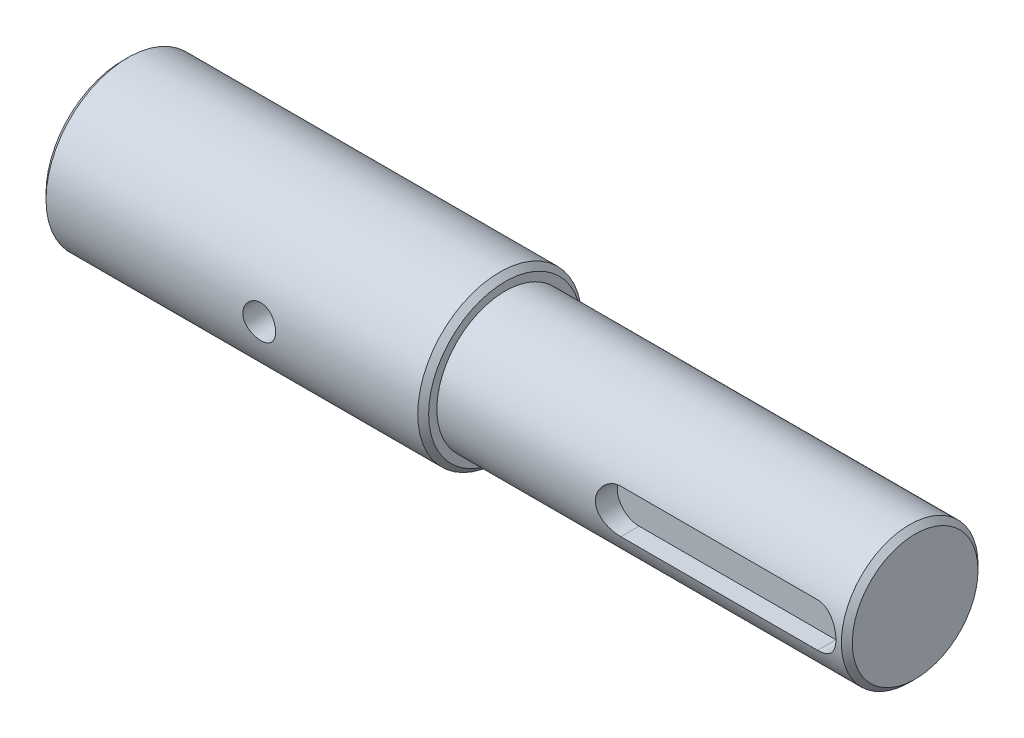
ISO-10303-21;
HEADER;
FILE_DESCRIPTION(('STEP AP214'),'2;1');
FILE_NAME('part.step','',(''),(''),'','','');
FILE_SCHEMA(('AUTOMOTIVE_DESIGN { 1 0 10303 214 1 1 1 1 }'));
ENDSEC;
DATA;
#1=APPLICATION_CONTEXT('core data for automotive mechanical design processes');
#2=APPLICATION_PROTOCOL_DEFINITION('international standard','automotive_design',2000,#1);
#3=PRODUCT_CONTEXT('',#1,'mechanical');
#4=PRODUCT('Part','Part','',(#3));
#5=PRODUCT_RELATED_PRODUCT_CATEGORY('part','',(#4));
#6=PRODUCT_DEFINITION_FORMATION('','',#4);
#7=PRODUCT_DEFINITION_CONTEXT('part definition',#1,'design');
#8=PRODUCT_DEFINITION('design','',#6,#7);
#9=PRODUCT_DEFINITION_SHAPE('','',#8);
#10=(LENGTH_UNIT() NAMED_UNIT(*) SI_UNIT(.MILLI.,.METRE.));
#11=(NAMED_UNIT(*) PLANE_ANGLE_UNIT() SI_UNIT($,.RADIAN.));
#12=(NAMED_UNIT(*) SI_UNIT($,.STERADIAN.) SOLID_ANGLE_UNIT());
#13=UNCERTAINTY_MEASURE_WITH_UNIT(LENGTH_MEASURE(1.E-05),#10,'distance_accuracy_value','');
#14=(GEOMETRIC_REPRESENTATION_CONTEXT(3) GLOBAL_UNCERTAINTY_ASSIGNED_CONTEXT((#13)) GLOBAL_UNIT_ASSIGNED_CONTEXT((#10,
#11,#12)) REPRESENTATION_CONTEXT('',''));
#15=CARTESIAN_POINT('',(0.,0.,0.));
#16=DIRECTION('',(0.,0.,1.));
#17=DIRECTION('',(1.,0.,0.));
#18=AXIS2_PLACEMENT_3D('',#15,#16,#17);
#19=CARTESIAN_POINT('',(75.,0.,0.));
#20=DIRECTION('',(-1.,0.,0.));
#21=DIRECTION('',(0.,0.,1.));
#22=AXIS2_PLACEMENT_3D('',#19,#20,#21);
#23=CYLINDRICAL_SURFACE('',#22,12.5);
#24=DIRECTION('',(-1.,0.,0.));
#25=VECTOR('',#24,1.);
#26=CARTESIAN_POINT('',(75.,-4.,11.842719282327));
#27=LINE('',#26,#25);
#28=CARTESIAN_POINT('',(68.9999992774947,-4.,11.842719282327));
#29=VERTEX_POINT('',#28);
#30=CARTESIAN_POINT('',(33.0000000860771,-4.,11.842719282327));
#31=VERTEX_POINT('',#30);
#32=EDGE_CURVE('E62',#29,#31,#27,.T.);
#33=ORIENTED_EDGE('',*,*,#32,.T.);
#34=CARTESIAN_POINT('',(33.0000000860771,-4.,11.842719282327));
#35=CARTESIAN_POINT('',(32.8906003144018,-4.00001410720039,11.8427027358106));
#36=CARTESIAN_POINT('',(32.7812098766924,-3.99551217993266,11.8442348036386));
#37=CARTESIAN_POINT('',(32.5632718459371,-3.97758607629383,11.8502730878636));
#38=CARTESIAN_POINT('',(32.4547240481456,-3.96416414063515,11.8547785573379));
#39=CARTESIAN_POINT('',(32.2395390554807,-3.92855726789797,11.866624202097));
#40=CARTESIAN_POINT('',(32.1328973904551,-3.90639677931233,11.8739564673804));
#41=CARTESIAN_POINT('',(31.9219944469661,-3.85353583875294,11.8912164916387));
#42=CARTESIAN_POINT('',(31.817733244712,-3.82283511378139,11.9011443335834));
#43=CARTESIAN_POINT('',(31.5096950788663,-3.71831767825502,11.934384073915));
#44=CARTESIAN_POINT('',(31.3103635295203,-3.63203547932865,11.9611699706487));
#45=CARTESIAN_POINT('',(30.9289875207174,-3.4289502588609,12.0209583821583));
#46=CARTESIAN_POINT('',(30.7469526964363,-3.31213036056589,12.0539643316417));
#47=CARTESIAN_POINT('',(30.3987460817276,-3.04678513884216,12.1237983926791));
#48=CARTESIAN_POINT('',(30.2332817430625,-2.89735310326957,12.1607158394894));
#49=CARTESIAN_POINT('',(29.9292852122408,-2.57296457099412,12.2334560987869));
#50=CARTESIAN_POINT('',(29.7907577088253,-2.39800363988275,12.2692787197911));
#51=CARTESIAN_POINT('',(29.5413848502421,-2.02237011324175,12.3368244517213));
#52=CARTESIAN_POINT('',(29.4312780873227,-1.82118403127888,12.3684294845299));
#53=CARTESIAN_POINT('',(29.2467505383842,-1.40197206380839,12.4229251547674));
#54=CARTESIAN_POINT('',(29.1723195547141,-1.18395101116351,12.4458182820424));
#55=CARTESIAN_POINT('',(29.0636411535197,-0.744714055182615,12.4796767755156));
#56=CARTESIAN_POINT('',(29.0281750790147,-0.52382801439202,12.4910030459863));
#57=CARTESIAN_POINT('',(28.9945672027649,-0.0789649088220831,12.501728711702));
#58=CARTESIAN_POINT('',(28.9964172630679,0.14501147136495,12.5011307074089));
#59=CARTESIAN_POINT('',(29.0365988159391,0.581094883607384,12.4883236715739));
#60=CARTESIAN_POINT('',(29.0736077498426,0.793338137008353,12.4765355857665));
#61=CARTESIAN_POINT('',(29.1808805241954,1.2084231135563,12.4431945873892));
#62=CARTESIAN_POINT('',(29.2511461755506,1.41126432407961,12.4216411430755));
#63=CARTESIAN_POINT('',(29.4237578014742,1.80478540726095,12.3706365105614));
#64=CARTESIAN_POINT('',(29.5264964745894,1.99528004806139,12.3410893195186));
#65=CARTESIAN_POINT('',(29.7608289950247,2.35673105677297,12.2771965545967));
#66=CARTESIAN_POINT('',(29.8924301481586,2.52768246110636,12.2428497666201));
#67=CARTESIAN_POINT('',(30.1874464647671,2.85304504965692,12.1712409251397));
#68=CARTESIAN_POINT('',(30.3519966320241,3.00641307161156,12.1339170507136));
#69=CARTESIAN_POINT('',(30.7049718219218,3.2837728630848,12.0618173045539));
#70=CARTESIAN_POINT('',(30.893404177119,3.40775557672525,12.0270422205738));
#71=CARTESIAN_POINT('',(31.1913711515791,3.56958203866888,11.9796198563288));
#72=CARTESIAN_POINT('',(31.2939989719462,3.61975670379803,11.9645161969642));
#73=CARTESIAN_POINT('',(31.5034046634222,3.7112307155423,11.936459169272));
#74=CARTESIAN_POINT('',(31.6101807975484,3.75253373059183,11.9235049126708));
#75=CARTESIAN_POINT('',(31.8270132360533,3.82585828763705,11.9001802433554));
#76=CARTESIAN_POINT('',(31.9370658854422,3.85788977366387,11.8898070640369));
#77=CARTESIAN_POINT('',(32.1596950632767,3.91241788552327,11.8719756739566));
#78=CARTESIAN_POINT('',(32.2722704096788,3.93491888254549,11.8645161269702));
#79=CARTESIAN_POINT('',(32.4872391399292,3.96832907132968,11.8533815935191));
#80=CARTESIAN_POINT('',(32.5894672983257,3.98020383324301,11.8493925990071));
#81=CARTESIAN_POINT('',(32.7944609376348,3.99603936376475,11.8440568041667));
#82=CARTESIAN_POINT('',(32.8972254864893,4.0000109913216,11.8427063784772));
#83=CARTESIAN_POINT('',(32.9999998369996,4.,11.842719282327));
#84=B_SPLINE_CURVE_WITH_KNOTS('',3,(#34,#35,#36,#37,#38,#39,#40,#41,#42,#43,#44,#45,#46,#47,#48,
#49,#50,#51,#52,#53,#54,#55,#56,#57,#58,#59,#60,#61,#62,#63,#64,#65,#66,#67,#68,#69,#70,#71,#72,
#73,#74,#75,#76,#77,#78,#79,#80,#81,#82,#83),.UNSPECIFIED.,.F.,.F.,(4,2,2,2,2,2,2,2,2,2,2,2,2,2,
2,2,2,2,2,2,2,2,2,2,4),(0.,0.328080176128682,0.656077969420186,0.983164536815614,
1.3102615610856,1.96355293479359,2.61720611810545,3.29209427005868,3.96709979098891,
4.65819583583337,5.34909421813099,6.01770820159006,6.68617637440314,7.33045501033754,
7.97476873278653,8.62719319487464,9.2797829928663,9.96076418413717,10.6419549661091,
10.987286277384,11.3324745178126,11.6772911484745,12.0219494561661,12.3305938215903,
12.6388138143909),.UNSPECIFIED.);
#85=CARTESIAN_POINT('',(32.9999998369996,4.,11.842719282327));
#86=VERTEX_POINT('',#85);
#87=EDGE_CURVE('E131',#31,#86,#84,.T.);
#88=ORIENTED_EDGE('',*,*,#87,.T.);
#89=DIRECTION('',(-1.,0.,0.));
#90=VECTOR('',#89,1.);
#91=CARTESIAN_POINT('',(75.,4.00000000000001,11.842719282327));
#92=LINE('',#91,#90);
#93=CARTESIAN_POINT('',(68.9999982755994,4.00000000000001,11.842719282327));
#94=VERTEX_POINT('',#93);
#95=EDGE_CURVE('E297',#86,#94,#92,.F.);
#96=ORIENTED_EDGE('',*,*,#95,.T.);
#97=CARTESIAN_POINT('',(68.9999982755994,3.99999999999985,11.8427192823271));
#98=CARTESIAN_POINT('',(69.1093980418243,4.00001415200929,11.8427027206751));
#99=CARTESIAN_POINT('',(69.2187884761679,3.99551226999122,11.8442347732199));
#100=CARTESIAN_POINT('',(69.4367265043864,3.97758625728691,11.8502730270746));
#101=CARTESIAN_POINT('',(69.5452743030055,3.96416436730995,11.8547784814629));
#102=CARTESIAN_POINT('',(69.7604593014549,3.92855758582248,11.8666240967698));
#103=CARTESIAN_POINT('',(69.8671009714258,3.90639714280525,11.873956347685));
#104=CARTESIAN_POINT('',(70.0780039287837,3.85353629300667,11.891216344319));
#105=CARTESIAN_POINT('',(70.1822651399617,3.82283561322847,11.9011441730073));
#106=CARTESIAN_POINT('',(70.490303338623,3.71831831205894,11.9343838758817));
#107=CARTESIAN_POINT('',(70.6896349175922,3.63203620125409,11.961169750665));
#108=CARTESIAN_POINT('',(71.0710109992735,3.4289511522421,12.0209581265521));
#109=CARTESIAN_POINT('',(71.2530458668238,3.31213133728936,12.0539640623659));
#110=CARTESIAN_POINT('',(71.6012525797277,3.0467862807256,12.123798104746));
#111=CARTESIAN_POINT('',(71.7667169740609,2.8973543271893,12.1607155468403));
#112=CARTESIAN_POINT('',(72.0707136299744,2.5729659515291,12.2334558073949));
#113=CARTESIAN_POINT('',(72.2092412027995,2.3980050949798,12.2692784343734));
#114=CARTESIAN_POINT('',(72.4586142245025,2.02237169559862,12.3368241914762));
#115=CARTESIAN_POINT('',(72.5687210791687,1.8211856645017,12.3684292433709));
#116=CARTESIAN_POINT('',(72.7532488195577,1.40197378259663,12.4229249601268));
#117=CARTESIAN_POINT('',(72.8276799029157,1.18395276464942,12.4458181148284));
#118=CARTESIAN_POINT('',(72.9363585082548,0.744715846577203,12.4796766684328));
#119=CARTESIAN_POINT('',(72.9718246850704,0.523829809055808,12.4910029708516));
#120=CARTESIAN_POINT('',(73.0054327628513,0.0789666912396402,12.5017287005618));
#121=CARTESIAN_POINT('',(73.003582801783,-0.145009704457568,12.5011307283194));
#122=CARTESIAN_POINT('',(72.9634014378144,-0.581093154829601,12.4883237522389));
#123=CARTESIAN_POINT('',(72.9263925953422,-0.793336430389009,12.476535694743));
#124=CARTESIAN_POINT('',(72.8191199975132,-1.20842146586216,12.4431947478591));
#125=CARTESIAN_POINT('',(72.7488544312639,-1.41126271315698,12.421641326731));
#126=CARTESIAN_POINT('',(72.5762429743765,-1.80478386891682,12.3706367354266));
#127=CARTESIAN_POINT('',(72.473504387288,-1.99527854671683,12.3410895628546));
#128=CARTESIAN_POINT('',(72.2391720332431,-2.35672964269956,12.2771968266469));
#129=CARTESIAN_POINT('',(72.1075709604653,-2.52768109730375,12.2428500489106));
#130=CARTESIAN_POINT('',(71.8125548012147,-2.85304380080759,12.1712412186634));
#131=CARTESIAN_POINT('',(71.6480047106927,-3.0064118880246,12.1339173448086));
#132=CARTESIAN_POINT('',(71.2950296653026,-3.28377182281207,12.0618175885975));
#133=CARTESIAN_POINT('',(71.1065973778965,-3.40775461453461,12.0270424939891));
#134=CARTESIAN_POINT('',(70.8086304889486,-3.56958120748968,11.979620104225));
#135=CARTESIAN_POINT('',(70.7060026904737,-3.61975592033176,11.9645164341958));
#136=CARTESIAN_POINT('',(70.496597038681,-3.71123002919121,11.9364593828678));
#137=CARTESIAN_POINT('',(70.3898209223469,-3.75253309364091,11.9235051132966));
#138=CARTESIAN_POINT('',(70.172988514453,-3.82585775099213,11.9001804160542));
#139=CARTESIAN_POINT('',(70.0629358778719,-3.85788928787991,11.8898072217929));
#140=CARTESIAN_POINT('',(69.840306720902,-3.91241750239313,11.8719758003429));
#141=CARTESIAN_POINT('',(69.7277313825547,-3.93491855119266,11.8645162369351));
#142=CARTESIAN_POINT('',(69.5127622203483,-3.9683289071876,11.8533816486579));
#143=CARTESIAN_POINT('',(69.4105336166547,-3.98020375046188,11.8493926268932));
#144=CARTESIAN_POINT('',(69.2055390799704,-3.99603937451484,11.8440568005294));
#145=CARTESIAN_POINT('',(69.1027740790443,-4.00001101430337,11.8427063705489));
#146=CARTESIAN_POINT('',(68.9999992774948,-4.00000000000016,11.842719282327));
#147=B_SPLINE_CURVE_WITH_KNOTS('',3,(#97,#98,#99,#100,#101,#102,#103,#104,#105,#106,#107,#108,
#109,#110,#111,#112,#113,#114,#115,#116,#117,#118,#119,#120,#121,#122,#123,#124,#125,#126,#127,
#128,#129,#130,#131,#132,#133,#134,#135,#136,#137,#138,#139,#140,#141,#142,#143,#144,#145,#146),
.UNSPECIFIED.,.F.,.F.,(4,2,2,2,2,2,2,2,2,2,2,2,2,2,2,2,2,2,2,2,2,2,2,2,4),(0.,0.328080159847334,
0.656077936973273,0.983164488231466,1.31026149632706,1.96355283869707,2.61720599042376,
3.29209410011394,3.96709957918656,4.65819563045912,5.34909401944465,6.01770804625576,
6.68617626216852,7.33045491139575,7.9747686468688,8.62719307697702,9.27978284311794,
9.96076400015375,10.641954747272,10.9872860665927,11.3324743151172,11.6772909554882,
12.0219492734327,12.3305949915373,12.6388163364732),.UNSPECIFIED.);
#148=EDGE_CURVE('E54',#94,#29,#147,.T.);
#149=ORIENTED_EDGE('',*,*,#148,.T.);
#150=EDGE_LOOP('',(#33,#88,#96,#149));
#151=FACE_BOUND('',#150,.T.);
#152=CARTESIAN_POINT('',(74.,0.,0.));
#153=DIRECTION('',(1.,0.,0.));
#154=DIRECTION('',(0.,0.,-1.));
#155=AXIS2_PLACEMENT_3D('',#152,#153,#154);
#156=CIRCLE('',#155,12.5);
#157=CARTESIAN_POINT('',(74.,0.,-12.5));
#158=VERTEX_POINT('',#157);
#159=EDGE_CURVE('E116',#158,#158,#156,.F.);
#160=ORIENTED_EDGE('',*,*,#159,.T.);
#161=EDGE_LOOP('',(#160));
#162=FACE_BOUND('',#161,.T.);
#163=CARTESIAN_POINT('',(0.,0.,0.));
#164=DIRECTION('',(1.,0.,0.));
#165=DIRECTION('',(0.,0.,-1.));
#166=AXIS2_PLACEMENT_3D('',#163,#164,#165);
#167=CIRCLE('',#166,12.5);
#168=CARTESIAN_POINT('',(0.,0.,-12.5));
#169=VERTEX_POINT('',#168);
#170=EDGE_CURVE('E107',#169,#169,#167,.T.);
#171=ORIENTED_EDGE('',*,*,#170,.T.);
#172=EDGE_LOOP('',(#171));
#173=FACE_BOUND('',#172,.T.);
#174=ADVANCED_FACE('F34',(#151,#162,#173),#23,.T.);
#175=CARTESIAN_POINT('',(75.,0.,0.));
#176=DIRECTION('',(1.,0.,0.));
#177=DIRECTION('',(0.,0.,-1.));
#178=AXIS2_PLACEMENT_3D('',#175,#176,#177);
#179=PLANE('',#178);
#180=CARTESIAN_POINT('',(75.,0.,0.));
#181=DIRECTION('',(1.,0.,0.));
#182=DIRECTION('',(0.,0.,-1.));
#183=AXIS2_PLACEMENT_3D('',#180,#181,#182);
#184=CIRCLE('',#183,11.5);
#185=CARTESIAN_POINT('',(75.,0.,-11.5));
#186=VERTEX_POINT('',#185);
#187=EDGE_CURVE('E113',#186,#186,#184,.T.);
#188=ORIENTED_EDGE('',*,*,#187,.T.);
#189=EDGE_LOOP('',(#188));
#190=FACE_BOUND('',#189,.T.);
#191=ADVANCED_FACE('F172',(#190),#179,.T.);
#192=CARTESIAN_POINT('',(-70.,0.,0.));
#193=DIRECTION('',(1.,0.,0.));
#194=DIRECTION('',(0.,0.,-1.));
#195=AXIS2_PLACEMENT_3D('',#192,#193,#194);
#196=CYLINDRICAL_SURFACE('',#195,15.);
#197=CARTESIAN_POINT('',(-27.,0.,-15.));
#198=CARTESIAN_POINT('',(-27.000006133495,0.166730720377896,-14.9999969274261));
#199=CARTESIAN_POINT('',(-27.0139465289029,0.333538980604564,-14.9971915553469));
#200=CARTESIAN_POINT('',(-27.0692955003457,0.662440523067055,-14.9862709686969));
#201=CARTESIAN_POINT('',(-27.1107258984045,0.824529952624065,-14.9781515358056));
#202=CARTESIAN_POINT('',(-27.2197238208624,1.13919091578994,-14.9575094783486));
#203=CARTESIAN_POINT('',(-27.2872663105341,1.2917714037994,-14.9449910723015));
#204=CARTESIAN_POINT('',(-27.4464967425339,1.58342396659267,-14.9169119410594));
#205=CARTESIAN_POINT('',(-27.5381832468216,1.72249684522743,-14.9013513970712));
#206=CARTESIAN_POINT('',(-27.7444154828743,1.98508043194459,-14.8686649598991));
#207=CARTESIAN_POINT('',(-27.8592250661736,2.10838185347557,-14.8515223651304));
#208=CARTESIAN_POINT('',(-28.1078772491751,2.33411026982408,-14.8177254135776));
#209=CARTESIAN_POINT('',(-28.2417213340054,2.43653563431127,-14.8010710950127));
#210=CARTESIAN_POINT('',(-28.5261485790356,2.61849526004286,-14.7699732543785));
#211=CARTESIAN_POINT('',(-28.6768729313891,2.6978128165976,-14.7555512209484));
#212=CARTESIAN_POINT('',(-28.9898454570122,2.82991699974092,-14.7307880417525));
#213=CARTESIAN_POINT('',(-29.152092490039,2.88270624731171,-14.7204464928588));
#214=CARTESIAN_POINT('',(-29.4812530917238,2.95957589965448,-14.7051841575661));
#215=CARTESIAN_POINT('',(-29.6480776324267,2.98402349387633,-14.7001941032156));
#216=CARTESIAN_POINT('',(-29.983529464093,3.00465638317835,-14.6959912518188));
#217=CARTESIAN_POINT('',(-30.1521565689604,3.0008445681405,-14.6967778640352));
#218=CARTESIAN_POINT('',(-30.483740364063,2.96536371930545,-14.7039765344455));
#219=CARTESIAN_POINT('',(-30.646744216882,2.93411562073171,-14.7103035857629));
#220=CARTESIAN_POINT('',(-30.965148229989,2.84531365386915,-14.7277363848));
#221=CARTESIAN_POINT('',(-31.120548026757,2.78775852930204,-14.7388423607334));
#222=CARTESIAN_POINT('',(-31.4205457851108,2.64757435102415,-14.7646685550122));
#223=CARTESIAN_POINT('',(-31.5650636387075,2.56477845369634,-14.7794126944111));
#224=CARTESIAN_POINT('',(-31.8383125499185,2.37658072371803,-14.8108385631919));
#225=CARTESIAN_POINT('',(-31.9670417905535,2.27117629307048,-14.827520515151));
#226=CARTESIAN_POINT('',(-32.2074882073708,2.03849980368175,-14.8613106372439));
#227=CARTESIAN_POINT('',(-32.3188577035774,1.91086848363733,-14.8784210763271));
#228=CARTESIAN_POINT('',(-32.5186615389037,1.63855507218602,-14.9108654614323));
#229=CARTESIAN_POINT('',(-32.6070955838807,1.49387276213816,-14.9261993846692));
#230=CARTESIAN_POINT('',(-32.7585825276779,1.19117816063675,-14.9534007048266));
#231=CARTESIAN_POINT('',(-32.8215956809336,1.03314545875589,-14.9652626654482));
#232=CARTESIAN_POINT('',(-32.9200814221157,0.708446929345989,-14.9841422696357));
#233=CARTESIAN_POINT('',(-32.9555573462209,0.541782150217344,-14.9911605000159));
#234=CARTESIAN_POINT('',(-32.9974693613828,0.207538216881447,-14.999480156006));
#235=CARTESIAN_POINT('',(-33.0043812586208,0.0400209849767247,-15.0008752395741));
#236=CARTESIAN_POINT('',(-32.9902504231735,-0.293774802578146,-14.9980515579031));
#237=CARTESIAN_POINT('',(-32.9692092619422,-0.460053427331383,-14.9938331082434));
#238=CARTESIAN_POINT('',(-32.9001648793681,-0.785116979839626,-14.9803149602405));
#239=CARTESIAN_POINT('',(-32.8524057945063,-0.943955845019714,-14.9710612921262));
#240=CARTESIAN_POINT('',(-32.7315480520326,-1.25137088249901,-14.948506561831));
#241=CARTESIAN_POINT('',(-32.6584474959695,-1.39994628491262,-14.9352051964268));
#242=CARTESIAN_POINT('',(-32.4879525280461,-1.68462352105866,-14.9057973459988));
#243=CARTESIAN_POINT('',(-32.3902716568832,-1.82055038025657,-14.8896585131116));
#244=CARTESIAN_POINT('',(-32.1737724263782,-2.07425405735762,-14.8564420448965));
#245=CARTESIAN_POINT('',(-32.0549518008004,-2.19202892679229,-14.8393643090516));
#246=CARTESIAN_POINT('',(-31.7973799443266,-2.40792177232253,-14.8058791067089));
#247=CARTESIAN_POINT('',(-31.658352767336,-2.50571310734597,-14.7894858069991));
#248=CARTESIAN_POINT('',(-31.36556591593,-2.67655626015362,-14.7595257538858));
#249=CARTESIAN_POINT('',(-31.2118068312793,-2.74960906776871,-14.7459588874003));
#250=CARTESIAN_POINT('',(-30.8946952615514,-2.86845552474589,-14.7233022175315));
#251=CARTESIAN_POINT('',(-30.7313974763691,-2.91439049937316,-14.7141892461656));
#252=CARTESIAN_POINT('',(-30.3991996395273,-2.97812595488159,-14.7014231037608));
#253=CARTESIAN_POINT('',(-30.230300321372,-2.99593010467534,-14.6977692207333));
#254=CARTESIAN_POINT('',(-29.8949734063671,-3.00276273260241,-14.6963744889414));
#255=CARTESIAN_POINT('',(-29.728556553219,-2.99230736421269,-14.698527575679));
#256=CARTESIAN_POINT('',(-29.3999050502849,-2.94405691230019,-14.7082672045384));
#257=CARTESIAN_POINT('',(-29.2376703669156,-2.9062620483879,-14.7158537030151));
#258=CARTESIAN_POINT('',(-28.9223168662784,-2.80463570549687,-14.7355579265748));
#259=CARTESIAN_POINT('',(-28.7691769184928,-2.74086752015204,-14.7476646305649));
#260=CARTESIAN_POINT('',(-28.4756888377967,-2.58916393380482,-14.7750514492251));
#261=CARTESIAN_POINT('',(-28.3353417788246,-2.50122650632465,-14.7903318299668));
#262=CARTESIAN_POINT('',(-28.0688532835491,-2.30191774435925,-14.8226688156968));
#263=CARTESIAN_POINT('',(-27.9429937041972,-2.19017366170555,-14.839751187291));
#264=CARTESIAN_POINT('',(-27.7116413834125,-1.94719310703943,-14.8735824561586));
#265=CARTESIAN_POINT('',(-27.6061533290482,-1.81595216146001,-14.8903312758955));
#266=CARTESIAN_POINT('',(-27.4174960681607,-1.53605288726474,-14.9218149716391));
#267=CARTESIAN_POINT('',(-27.3345719901599,-1.38722665328951,-14.9365269365774));
#268=CARTESIAN_POINT('',(-27.1950416322102,-1.0774990828222,-14.96205375255));
#269=CARTESIAN_POINT('',(-27.1384116314025,-0.916608782589383,-14.9728721141585));
#270=CARTESIAN_POINT('',(-27.0640441558659,-0.629464466771343,-14.9872911778611));
#271=CARTESIAN_POINT('',(-27.0400704188767,-0.504844992041359,-14.9920290947536));
#272=CARTESIAN_POINT('',(-27.0080462629249,-0.253498575630206,-14.9983846241968));
#273=CARTESIAN_POINT('',(-26.9999953364707,-0.126771701245861,-15.0000023361946));
#274=CARTESIAN_POINT('',(-27.,0.,-15.));
#275=B_SPLINE_CURVE_WITH_KNOTS('',3,(#197,#198,#199,#200,#201,#202,#203,#204,#205,#206,#207,
#208,#209,#210,#211,#212,#213,#214,#215,#216,#217,#218,#219,#220,#221,#222,#223,#224,#225,#226,
#227,#228,#229,#230,#231,#232,#233,#234,#235,#236,#237,#238,#239,#240,#241,#242,#243,#244,#245,
#246,#247,#248,#249,#250,#251,#252,#253,#254,#255,#256,#257,#258,#259,#260,#261,#262,#263,#264,
#265,#266,#267,#268,#269,#270,#271,#272,#273,#274),.UNSPECIFIED.,.T.,.F.,(4,2,2,2,2,2,2,2,2,2,2,
2,2,2,2,2,2,2,2,2,2,2,2,2,2,2,2,2,2,2,2,2,2,2,2,2,2,2,4),(0.,0.499728391983776,0.99985395207397,
1.49950120575103,1.99911870669259,2.50479801033656,3.0105167902421,3.52083585017768,
4.03110448095593,4.53468555310762,5.03821512843676,5.53415181018836,6.03011217761189,
6.52942470610778,7.02879464249012,7.53714757474052,8.04550702619461,8.55465824562072,
9.06374777094108,9.56432207028796,10.064868229736,10.5609136185217,11.0569961764807,
11.5591519810008,12.0613616503779,12.5712188573768,13.081055661704,13.5882114309817,
14.0953010499124,14.593191677031,15.0910783047783,15.5877588375933,16.084481027456,
16.5896422871743,17.0949196359879,17.6054849002691,18.1155886655256,18.4955632586968,
18.8755257411299),.UNSPECIFIED.);
#276=CARTESIAN_POINT('',(-27.,0.,-15.));
#277=VERTEX_POINT('',#276);
#278=EDGE_CURVE('E11',#277,#277,#275,.T.);
#279=ORIENTED_EDGE('',*,*,#278,.T.);
#280=EDGE_LOOP('',(#279));
#281=FACE_BOUND('',#280,.T.);
#282=CARTESIAN_POINT('',(-27.,0.,15.));
#283=CARTESIAN_POINT('',(-27.000006133495,-0.1667307203779,14.9999969274261));
#284=CARTESIAN_POINT('',(-27.0139465289029,-0.333538980604567,14.9971915553469));
#285=CARTESIAN_POINT('',(-27.0692955003457,-0.662440523067058,14.9862709686969));
#286=CARTESIAN_POINT('',(-27.1107258984045,-0.824529952624067,14.9781515358056));
#287=CARTESIAN_POINT('',(-27.2197238208624,-1.13919091578994,14.9575094783486));
#288=CARTESIAN_POINT('',(-27.2872663105341,-1.2917714037994,14.9449910723015));
#289=CARTESIAN_POINT('',(-27.4464967425339,-1.58342396659268,14.9169119410594));
#290=CARTESIAN_POINT('',(-27.5381832468216,-1.72249684522744,14.9013513970712));
#291=CARTESIAN_POINT('',(-27.7444154828743,-1.9850804319446,14.8686649598991));
#292=CARTESIAN_POINT('',(-27.8592250661736,-2.10838185347557,14.8515223651304));
#293=CARTESIAN_POINT('',(-28.1078772491751,-2.33411026982409,14.8177254135776));
#294=CARTESIAN_POINT('',(-28.2417213340054,-2.43653563431128,14.8010710950127));
#295=CARTESIAN_POINT('',(-28.5261485790356,-2.61849526004286,14.7699732543785));
#296=CARTESIAN_POINT('',(-28.6768729313891,-2.6978128165976,14.7555512209484));
#297=CARTESIAN_POINT('',(-28.9898454570122,-2.82991699974093,14.7307880417525));
#298=CARTESIAN_POINT('',(-29.152092490039,-2.88270624731172,14.7204464928589));
#299=CARTESIAN_POINT('',(-29.4812530917238,-2.95957589965448,14.7051841575661));
#300=CARTESIAN_POINT('',(-29.6480776324267,-2.98402349387634,14.7001941032156));
#301=CARTESIAN_POINT('',(-29.983529464093,-3.00465638317836,14.6959912518188));
#302=CARTESIAN_POINT('',(-30.1521565689604,-3.0008445681405,14.6967778640352));
#303=CARTESIAN_POINT('',(-30.483740364063,-2.96536371930546,14.7039765344455));
#304=CARTESIAN_POINT('',(-30.6467442168819,-2.93411562073172,14.7103035857629));
#305=CARTESIAN_POINT('',(-30.965148229989,-2.84531365386916,14.7277363848));
#306=CARTESIAN_POINT('',(-31.120548026757,-2.78775852930205,14.7388423607334));
#307=CARTESIAN_POINT('',(-31.4205457851108,-2.64757435102417,14.7646685550122));
#308=CARTESIAN_POINT('',(-31.5650636387075,-2.56477845369635,14.7794126944111));
#309=CARTESIAN_POINT('',(-31.8383125499184,-2.37658072371805,14.8108385631919));
#310=CARTESIAN_POINT('',(-31.9670417905535,-2.2711762930705,14.827520515151));
#311=CARTESIAN_POINT('',(-32.2074882073708,-2.03849980368176,14.8613106372439));
#312=CARTESIAN_POINT('',(-32.3188577035774,-1.91086848363734,14.8784210763271));
#313=CARTESIAN_POINT('',(-32.5186615389037,-1.63855507218604,14.9108654614323));
#314=CARTESIAN_POINT('',(-32.6070955838807,-1.49387276213818,14.9261993846692));
#315=CARTESIAN_POINT('',(-32.7585825276779,-1.19117816063677,14.9534007048266));
#316=CARTESIAN_POINT('',(-32.8215956809336,-1.03314545875591,14.9652626654482));
#317=CARTESIAN_POINT('',(-32.9200814221157,-0.708446929346002,14.9841422696357));
#318=CARTESIAN_POINT('',(-32.9555573462209,-0.541782150217357,14.9911605000159));
#319=CARTESIAN_POINT('',(-32.9974693613828,-0.207538216881461,14.999480156006));
#320=CARTESIAN_POINT('',(-33.0043812586208,-0.0400209849767378,15.0008752395741));
#321=CARTESIAN_POINT('',(-32.9902504231735,0.293774802578134,14.9980515579031));
#322=CARTESIAN_POINT('',(-32.9692092619422,0.460053427331372,14.9938331082434));
#323=CARTESIAN_POINT('',(-32.9001648793681,0.785116979839616,14.9803149602405));
#324=CARTESIAN_POINT('',(-32.8524057945063,0.943955845019704,14.9710612921262));
#325=CARTESIAN_POINT('',(-32.7315480520326,1.251370882499,14.948506561831));
#326=CARTESIAN_POINT('',(-32.6584474959695,1.39994628491261,14.9352051964268));
#327=CARTESIAN_POINT('',(-32.4879525280461,1.68462352105865,14.9057973459988));
#328=CARTESIAN_POINT('',(-32.3902716568832,1.82055038025656,14.8896585131116));
#329=CARTESIAN_POINT('',(-32.1737724263782,2.07425405735761,14.8564420448965));
#330=CARTESIAN_POINT('',(-32.0549518008004,2.19202892679228,14.8393643090516));
#331=CARTESIAN_POINT('',(-31.7973799443266,2.40792177232252,14.805879106709));
#332=CARTESIAN_POINT('',(-31.658352767336,2.50571310734596,14.7894858069991));
#333=CARTESIAN_POINT('',(-31.36556591593,2.67655626015361,14.7595257538858));
#334=CARTESIAN_POINT('',(-31.2118068312794,2.7496090677687,14.7459588874003));
#335=CARTESIAN_POINT('',(-30.8946952615514,2.86845552474588,14.7233022175315));
#336=CARTESIAN_POINT('',(-30.7313974763691,2.91439049937315,14.7141892461656));
#337=CARTESIAN_POINT('',(-30.3991996395273,2.97812595488159,14.7014231037608));
#338=CARTESIAN_POINT('',(-30.230300321372,2.99593010467533,14.6977692207333));
#339=CARTESIAN_POINT('',(-29.8949734063671,3.0027627326024,14.6963744889414));
#340=CARTESIAN_POINT('',(-29.728556553219,2.99230736421269,14.698527575679));
#341=CARTESIAN_POINT('',(-29.3999050502849,2.94405691230018,14.7082672045384));
#342=CARTESIAN_POINT('',(-29.2376703669156,2.90626204838789,14.7158537030151));
#343=CARTESIAN_POINT('',(-28.9223168662784,2.80463570549686,14.7355579265748));
#344=CARTESIAN_POINT('',(-28.7691769184928,2.74086752015203,14.7476646305649));
#345=CARTESIAN_POINT('',(-28.4756888377967,2.58916393380481,14.7750514492251));
#346=CARTESIAN_POINT('',(-28.3353417788246,2.50122650632465,14.7903318299668));
#347=CARTESIAN_POINT('',(-28.0688532835491,2.30191774435924,14.8226688156968));
#348=CARTESIAN_POINT('',(-27.9429937041972,2.19017366170554,14.839751187291));
#349=CARTESIAN_POINT('',(-27.7116413834125,1.94719310703942,14.8735824561586));
#350=CARTESIAN_POINT('',(-27.6061533290482,1.81595216146001,14.8903312758955));
#351=CARTESIAN_POINT('',(-27.4174960681607,1.53605288726474,14.9218149716391));
#352=CARTESIAN_POINT('',(-27.3345719901599,1.38722665328951,14.9365269365774));
#353=CARTESIAN_POINT('',(-27.1950416322102,1.0774990828222,14.96205375255));
#354=CARTESIAN_POINT('',(-27.1384116314025,0.91660878258938,14.9728721141585));
#355=CARTESIAN_POINT('',(-27.0640441558659,0.629464466771339,14.9872911778611));
#356=CARTESIAN_POINT('',(-27.0400704188767,0.504844992041354,14.9920290947535));
#357=CARTESIAN_POINT('',(-27.0080462629249,0.2534985756302,14.9983846241968));
#358=CARTESIAN_POINT('',(-26.9999953364707,0.126771701245857,15.0000023361946));
#359=CARTESIAN_POINT('',(-27.,0.,15.));
#360=B_SPLINE_CURVE_WITH_KNOTS('',3,(#282,#283,#284,#285,#286,#287,#288,#289,#290,#291,#292,
#293,#294,#295,#296,#297,#298,#299,#300,#301,#302,#303,#304,#305,#306,#307,#308,#309,#310,#311,
#312,#313,#314,#315,#316,#317,#318,#319,#320,#321,#322,#323,#324,#325,#326,#327,#328,#329,#330,
#331,#332,#333,#334,#335,#336,#337,#338,#339,#340,#341,#342,#343,#344,#345,#346,#347,#348,#349,
#350,#351,#352,#353,#354,#355,#356,#357,#358,#359),.UNSPECIFIED.,.T.,.F.,(4,2,2,2,2,2,2,2,2,2,2,
2,2,2,2,2,2,2,2,2,2,2,2,2,2,2,2,2,2,2,2,2,2,2,2,2,2,2,4),(0.,0.499728391983775,
0.999853952073969,1.49950120575102,1.99911870669259,2.50479801033656,3.0105167902421,
3.52083585017768,4.03110448095593,4.53468555310762,5.03821512843676,5.53415181018835,
6.03011217761189,6.52942470610778,7.02879464249011,7.53714757474052,8.04550702619461,
8.55465824562072,9.06374777094108,9.56432207028796,10.064868229736,10.5609136185217,
11.0569961764807,11.5591519810008,12.0613616503779,12.5712188573768,13.081055661704,
13.5882114309817,14.0953010499124,14.593191677031,15.0910783047783,15.5877588375933,
16.084481027456,16.5896422871743,17.0949196359879,17.6054849002691,18.1155886655256,
18.4955632586968,18.8755257411299),.UNSPECIFIED.);
#361=CARTESIAN_POINT('',(-27.,0.,15.));
#362=VERTEX_POINT('',#361);
#363=EDGE_CURVE('E47',#362,#362,#360,.T.);
#364=ORIENTED_EDGE('',*,*,#363,.T.);
#365=EDGE_LOOP('',(#364));
#366=FACE_BOUND('',#365,.T.);
#367=CARTESIAN_POINT('',(-1.,0.,0.));
#368=DIRECTION('',(-1.,0.,0.));
#369=DIRECTION('',(0.,0.,1.));
#370=AXIS2_PLACEMENT_3D('',#367,#368,#369);
#371=CIRCLE('',#370,15.);
#372=CARTESIAN_POINT('',(-1.,0.,15.));
#373=VERTEX_POINT('',#372);
#374=EDGE_CURVE('E122',#373,#373,#371,.T.);
#375=ORIENTED_EDGE('',*,*,#374,.T.);
#376=EDGE_LOOP('',(#375));
#377=FACE_BOUND('',#376,.T.);
#378=CARTESIAN_POINT('',(-69.,0.,0.));
#379=DIRECTION('',(-1.,0.,0.));
#380=DIRECTION('',(0.,0.,1.));
#381=AXIS2_PLACEMENT_3D('',#378,#379,#380);
#382=CIRCLE('',#381,15.);
#383=CARTESIAN_POINT('',(-69.,0.,15.));
#384=VERTEX_POINT('',#383);
#385=EDGE_CURVE('E119',#384,#384,#382,.F.);
#386=ORIENTED_EDGE('',*,*,#385,.T.);
#387=EDGE_LOOP('',(#386));
#388=FACE_BOUND('',#387,.T.);
#389=ADVANCED_FACE('F165',(#281,#366,#377,#388),#196,.T.);
#390=CARTESIAN_POINT('',(-70.,0.,0.));
#391=DIRECTION('',(-1.,0.,0.));
#392=DIRECTION('',(0.,0.,1.));
#393=AXIS2_PLACEMENT_3D('',#390,#391,#392);
#394=PLANE('',#393);
#395=CARTESIAN_POINT('',(-70.,0.,0.));
#396=DIRECTION('',(-1.,0.,0.));
#397=DIRECTION('',(0.,0.,1.));
#398=AXIS2_PLACEMENT_3D('',#395,#396,#397);
#399=CIRCLE('',#398,14.);
#400=CARTESIAN_POINT('',(-70.,0.,14.));
#401=VERTEX_POINT('',#400);
#402=EDGE_CURVE('E128',#401,#401,#399,.T.);
#403=ORIENTED_EDGE('',*,*,#402,.T.);
#404=EDGE_LOOP('',(#403));
#405=FACE_BOUND('',#404,.T.);
#406=ADVANCED_FACE('F161',(#405),#394,.T.);
#407=CARTESIAN_POINT('',(0.,0.,0.));
#408=DIRECTION('',(-1.,0.,0.));
#409=DIRECTION('',(0.,0.,1.));
#410=AXIS2_PLACEMENT_3D('',#407,#408,#409);
#411=PLANE('',#410);
#412=CARTESIAN_POINT('',(0.,0.,0.));
#413=DIRECTION('',(-1.,0.,0.));
#414=DIRECTION('',(0.,0.,1.));
#415=AXIS2_PLACEMENT_3D('',#412,#413,#414);
#416=CIRCLE('',#415,14.);
#417=CARTESIAN_POINT('',(0.,0.,14.));
#418=VERTEX_POINT('',#417);
#419=EDGE_CURVE('E125',#418,#418,#416,.F.);
#420=ORIENTED_EDGE('',*,*,#419,.T.);
#421=EDGE_LOOP('',(#420));
#422=FACE_BOUND('',#421,.T.);
#423=ORIENTED_EDGE('',*,*,#170,.F.);
#424=EDGE_LOOP('',(#423));
#425=FACE_BOUND('',#424,.T.);
#426=ADVANCED_FACE('F164',(#422,#425),#411,.F.);
#427=CARTESIAN_POINT('',(75.,0.,0.));
#428=DIRECTION('',(-1.,0.,0.));
#429=DIRECTION('',(0.,0.,1.));
#430=AXIS2_PLACEMENT_3D('',#427,#428,#429);
#431=CONICAL_SURFACE('',#430,11.5,0.785398163397445);
#432=ORIENTED_EDGE('',*,*,#159,.F.);
#433=EDGE_LOOP('',(#432));
#434=FACE_BOUND('',#433,.T.);
#435=ORIENTED_EDGE('',*,*,#187,.F.);
#436=EDGE_LOOP('',(#435));
#437=FACE_BOUND('',#436,.T.);
#438=ADVANCED_FACE('F168',(#434,#437),#431,.T.);
#439=CARTESIAN_POINT('',(-1.,0.,0.));
#440=DIRECTION('',(-1.,0.,0.));
#441=DIRECTION('',(0.,0.,1.));
#442=AXIS2_PLACEMENT_3D('',#439,#440,#441);
#443=CONICAL_SURFACE('',#442,15.,0.785398163397447);
#444=ORIENTED_EDGE('',*,*,#419,.F.);
#445=EDGE_LOOP('',(#444));
#446=FACE_BOUND('',#445,.T.);
#447=ORIENTED_EDGE('',*,*,#374,.F.);
#448=EDGE_LOOP('',(#447));
#449=FACE_BOUND('',#448,.T.);
#450=ADVANCED_FACE('F202',(#446,#449),#443,.T.);
#451=CARTESIAN_POINT('',(-70.,0.,0.));
#452=DIRECTION('',(1.,0.,0.));
#453=DIRECTION('',(0.,0.,-1.));
#454=AXIS2_PLACEMENT_3D('',#451,#452,#453);
#455=CONICAL_SURFACE('',#454,14.,0.785398163397442);
#456=ORIENTED_EDGE('',*,*,#385,.F.);
#457=EDGE_LOOP('',(#456));
#458=FACE_BOUND('',#457,.T.);
#459=ORIENTED_EDGE('',*,*,#402,.F.);
#460=EDGE_LOOP('',(#459));
#461=FACE_BOUND('',#460,.T.);
#462=ADVANCED_FACE('F36',(#458,#461),#455,.T.);
#463=CARTESIAN_POINT('',(69.,0.,8.5));
#464=DIRECTION('',(0.,0.,1.));
#465=DIRECTION('',(1.,0.,0.));
#466=AXIS2_PLACEMENT_3D('',#463,#464,#465);
#467=CYLINDRICAL_SURFACE('',#466,4.00000000000022);
#468=DIRECTION('',(0.,0.,1.));
#469=VECTOR('',#468,1.);
#470=CARTESIAN_POINT('',(68.9999982755994,4.00000000000001,8.5));
#471=LINE('',#470,#469);
#472=CARTESIAN_POINT('',(68.9999982755994,4.00000000000001,8.5));
#473=VERTEX_POINT('',#472);
#474=EDGE_CURVE('E79',#473,#94,#471,.T.);
#475=ORIENTED_EDGE('',*,*,#474,.F.);
#476=CARTESIAN_POINT('',(69.,0.,8.5));
#477=DIRECTION('',(0.,0.,1.));
#478=DIRECTION('',(1.,0.,0.));
#479=AXIS2_PLACEMENT_3D('',#476,#477,#478);
#480=CIRCLE('',#479,4.00000000000022);
#481=CARTESIAN_POINT('',(68.9999992774947,-4.,8.5));
#482=VERTEX_POINT('',#481);
#483=EDGE_CURVE('E83',#482,#473,#480,.T.);
#484=ORIENTED_EDGE('',*,*,#483,.F.);
#485=DIRECTION('',(0.,0.,1.));
#486=VECTOR('',#485,1.);
#487=CARTESIAN_POINT('',(68.9999992774947,-4.,8.5));
#488=LINE('',#487,#486);
#489=EDGE_CURVE('E105',#482,#29,#488,.T.);
#490=ORIENTED_EDGE('',*,*,#489,.T.);
#491=ORIENTED_EDGE('',*,*,#148,.F.);
#492=EDGE_LOOP('',(#475,#484,#490,#491));
#493=FACE_BOUND('',#492,.T.);
#494=ADVANCED_FACE('F81',(#493),#467,.F.);
#495=CARTESIAN_POINT('',(33.0000000860771,-4.,8.5));
#496=DIRECTION('',(0.,-1.,0.));
#497=DIRECTION('',(0.,0.,-1.));
#498=AXIS2_PLACEMENT_3D('',#495,#496,#497);
#499=PLANE('',#498);
#500=ORIENTED_EDGE('',*,*,#489,.F.);
#501=DIRECTION('',(1.,0.,0.));
#502=VECTOR('',#501,1.);
#503=CARTESIAN_POINT('',(33.0000000860771,-4.,8.5));
#504=LINE('',#503,#502);
#505=CARTESIAN_POINT('',(33.0000000860771,-4.,8.5));
#506=VERTEX_POINT('',#505);
#507=EDGE_CURVE('E88',#506,#482,#504,.T.);
#508=ORIENTED_EDGE('',*,*,#507,.F.);
#509=DIRECTION('',(0.,0.,1.));
#510=VECTOR('',#509,1.);
#511=CARTESIAN_POINT('',(33.0000000860771,-4.,8.5));
#512=LINE('',#511,#510);
#513=EDGE_CURVE('E108',#506,#31,#512,.T.);
#514=ORIENTED_EDGE('',*,*,#513,.T.);
#515=ORIENTED_EDGE('',*,*,#32,.F.);
#516=EDGE_LOOP('',(#500,#508,#514,#515));
#517=FACE_BOUND('',#516,.T.);
#518=ADVANCED_FACE('F154',(#517),#499,.F.);
#519=CARTESIAN_POINT('',(33.,0.,8.5));
#520=DIRECTION('',(0.,0.,1.));
#521=DIRECTION('',(1.,0.,0.));
#522=AXIS2_PLACEMENT_3D('',#519,#520,#521);
#523=CYLINDRICAL_SURFACE('',#522,4.);
#524=ORIENTED_EDGE('',*,*,#513,.F.);
#525=CARTESIAN_POINT('',(33.,0.,8.5));
#526=DIRECTION('',(0.,0.,1.));
#527=DIRECTION('',(1.,0.,0.));
#528=AXIS2_PLACEMENT_3D('',#525,#526,#527);
#529=CIRCLE('',#528,4.);
#530=CARTESIAN_POINT('',(32.9999998369996,4.,8.5));
#531=VERTEX_POINT('',#530);
#532=EDGE_CURVE('E97',#531,#506,#529,.T.);
#533=ORIENTED_EDGE('',*,*,#532,.F.);
#534=DIRECTION('',(0.,0.,1.));
#535=VECTOR('',#534,1.);
#536=CARTESIAN_POINT('',(32.9999998369996,4.,8.5));
#537=LINE('',#536,#535);
#538=EDGE_CURVE('E87',#531,#86,#537,.T.);
#539=ORIENTED_EDGE('',*,*,#538,.T.);
#540=ORIENTED_EDGE('',*,*,#87,.F.);
#541=EDGE_LOOP('',(#524,#533,#539,#540));
#542=FACE_BOUND('',#541,.T.);
#543=ADVANCED_FACE('F149',(#542),#523,.F.);
#544=CARTESIAN_POINT('',(32.9999998369996,4.,8.5));
#545=DIRECTION('',(0.,1.,0.));
#546=DIRECTION('',(-1.,0.,0.));
#547=AXIS2_PLACEMENT_3D('',#544,#545,#546);
#548=PLANE('',#547);
#549=ORIENTED_EDGE('',*,*,#538,.F.);
#550=DIRECTION('',(-1.,0.,0.));
#551=VECTOR('',#550,1.);
#552=CARTESIAN_POINT('',(32.9999998369996,4.,8.5));
#553=LINE('',#552,#551);
#554=EDGE_CURVE('E91',#473,#531,#553,.T.);
#555=ORIENTED_EDGE('',*,*,#554,.F.);
#556=ORIENTED_EDGE('',*,*,#474,.T.);
#557=ORIENTED_EDGE('',*,*,#95,.F.);
#558=EDGE_LOOP('',(#549,#555,#556,#557));
#559=FACE_BOUND('',#558,.T.);
#560=ADVANCED_FACE('F92',(#559),#548,.F.);
#561=CARTESIAN_POINT('',(69.,0.,8.5));
#562=DIRECTION('',(0.,0.,1.));
#563=DIRECTION('',(1.,0.,0.));
#564=AXIS2_PLACEMENT_3D('',#561,#562,#563);
#565=PLANE('',#564);
#566=ORIENTED_EDGE('',*,*,#483,.T.);
#567=ORIENTED_EDGE('',*,*,#554,.T.);
#568=ORIENTED_EDGE('',*,*,#532,.T.);
#569=ORIENTED_EDGE('',*,*,#507,.T.);
#570=EDGE_LOOP('',(#566,#567,#568,#569));
#571=FACE_BOUND('',#570,.T.);
#572=ADVANCED_FACE('F99',(#571),#565,.T.);
#573=CARTESIAN_POINT('',(-30.,0.,-15.));
#574=DIRECTION('',(0.,0.,1.));
#575=DIRECTION('',(1.,0.,0.));
#576=AXIS2_PLACEMENT_3D('',#573,#574,#575);
#577=CYLINDRICAL_SURFACE('',#576,3.);
#578=ORIENTED_EDGE('',*,*,#363,.F.);
#579=EDGE_LOOP('',(#578));
#580=FACE_BOUND('',#579,.T.);
#581=ORIENTED_EDGE('',*,*,#278,.F.);
#582=EDGE_LOOP('',(#581));
#583=FACE_BOUND('',#582,.T.);
#584=ADVANCED_FACE('F180',(#580,#583),#577,.F.);
#585=CLOSED_SHELL('',(#174,#191,#389,#406,#426,#438,#450,#462,#494,#518,#543,#560,#572,#584));
#586=MANIFOLD_SOLID_BREP('B2',#585);
#587=ADVANCED_BREP_SHAPE_REPRESENTATION('',(#18,#586),#14);
#588=SHAPE_DEFINITION_REPRESENTATION(#9,#587);
ENDSEC;
END-ISO-10303-21;
